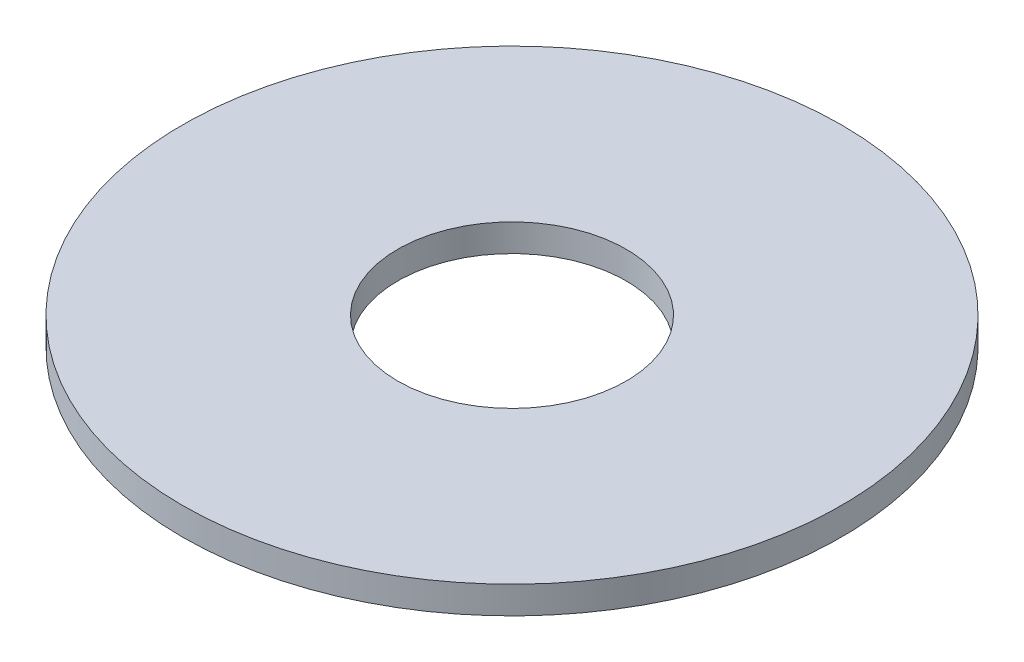
ISO-10303-21;
HEADER;
FILE_DESCRIPTION(('STEP AP214'),'2;1');
FILE_NAME('part.step','',(''),(''),'','','');
FILE_SCHEMA(('AUTOMOTIVE_DESIGN { 1 0 10303 214 1 1 1 1 }'));
ENDSEC;
DATA;
#1=APPLICATION_CONTEXT('core data for automotive mechanical design processes');
#2=APPLICATION_PROTOCOL_DEFINITION('international standard','automotive_design',2000,#1);
#3=PRODUCT_CONTEXT('',#1,'mechanical');
#4=PRODUCT('Part','Part','',(#3));
#5=PRODUCT_RELATED_PRODUCT_CATEGORY('part','',(#4));
#6=PRODUCT_DEFINITION_FORMATION('','',#4);
#7=PRODUCT_DEFINITION_CONTEXT('part definition',#1,'design');
#8=PRODUCT_DEFINITION('design','',#6,#7);
#9=PRODUCT_DEFINITION_SHAPE('','',#8);
#10=(LENGTH_UNIT() NAMED_UNIT(*) SI_UNIT(.MILLI.,.METRE.));
#11=(NAMED_UNIT(*) PLANE_ANGLE_UNIT() SI_UNIT($,.RADIAN.));
#12=(NAMED_UNIT(*) SI_UNIT($,.STERADIAN.) SOLID_ANGLE_UNIT());
#13=UNCERTAINTY_MEASURE_WITH_UNIT(LENGTH_MEASURE(1.E-05),#10,'distance_accuracy_value','');
#14=(GEOMETRIC_REPRESENTATION_CONTEXT(3) GLOBAL_UNCERTAINTY_ASSIGNED_CONTEXT((#13)) GLOBAL_UNIT_ASSIGNED_CONTEXT((#10,
#11,#12)) REPRESENTATION_CONTEXT('',''));
#15=CARTESIAN_POINT('',(0.,0.,0.));
#16=DIRECTION('',(0.,0.,1.));
#17=DIRECTION('',(1.,0.,0.));
#18=AXIS2_PLACEMENT_3D('',#15,#16,#17);
#19=CARTESIAN_POINT('',(0.,-0.396875,0.));
#20=DIRECTION('',(0.,1.,0.));
#21=DIRECTION('',(0.,0.,1.));
#22=AXIS2_PLACEMENT_3D('',#19,#20,#21);
#23=PLANE('',#22);
#24=CARTESIAN_POINT('',(0.,-0.396875,0.));
#25=DIRECTION('',(0.,1.,0.));
#26=DIRECTION('',(0.,0.,1.));
#27=AXIS2_PLACEMENT_3D('',#24,#25,#26);
#28=CIRCLE('',#27,3.302);
#29=CARTESIAN_POINT('',(0.,-0.396875,3.302));
#30=VERTEX_POINT('',#29);
#31=EDGE_CURVE('E27',#30,#30,#28,.T.);
#32=ORIENTED_EDGE('',*,*,#31,.T.);
#33=EDGE_LOOP('',(#32));
#34=FACE_BOUND('',#33,.T.);
#35=CARTESIAN_POINT('',(0.,-0.396875,0.));
#36=DIRECTION('',(0.,1.,0.));
#37=DIRECTION('',(0.,0.,1.));
#38=AXIS2_PLACEMENT_3D('',#35,#36,#37);
#39=CIRCLE('',#38,9.525);
#40=CARTESIAN_POINT('',(0.,-0.396875,9.525));
#41=VERTEX_POINT('',#40);
#42=EDGE_CURVE('E18',#41,#41,#39,.T.);
#43=ORIENTED_EDGE('',*,*,#42,.F.);
#44=EDGE_LOOP('',(#43));
#45=FACE_BOUND('',#44,.T.);
#46=ADVANCED_FACE('F15',(#34,#45),#23,.F.);
#47=CARTESIAN_POINT('',(0.,0.396875,0.));
#48=DIRECTION('',(0.,1.,0.));
#49=DIRECTION('',(0.,0.,1.));
#50=AXIS2_PLACEMENT_3D('',#47,#48,#49);
#51=CYLINDRICAL_SURFACE('',#50,9.525);
#52=ORIENTED_EDGE('',*,*,#42,.T.);
#53=EDGE_LOOP('',(#52));
#54=FACE_BOUND('',#53,.T.);
#55=CARTESIAN_POINT('',(0.,0.396875,0.));
#56=DIRECTION('',(0.,1.,0.));
#57=DIRECTION('',(0.,0.,1.));
#58=AXIS2_PLACEMENT_3D('',#55,#56,#57);
#59=CIRCLE('',#58,9.525);
#60=CARTESIAN_POINT('',(0.,0.396875,9.525));
#61=VERTEX_POINT('',#60);
#62=EDGE_CURVE('E22',#61,#61,#59,.T.);
#63=ORIENTED_EDGE('',*,*,#62,.F.);
#64=EDGE_LOOP('',(#63));
#65=FACE_BOUND('',#64,.T.);
#66=ADVANCED_FACE('F35',(#54,#65),#51,.T.);
#67=CARTESIAN_POINT('',(0.,0.396875,0.));
#68=DIRECTION('',(0.,1.,0.));
#69=DIRECTION('',(0.,0.,1.));
#70=AXIS2_PLACEMENT_3D('',#67,#68,#69);
#71=CYLINDRICAL_SURFACE('',#70,3.302);
#72=ORIENTED_EDGE('',*,*,#31,.F.);
#73=EDGE_LOOP('',(#72));
#74=FACE_BOUND('',#73,.T.);
#75=CARTESIAN_POINT('',(0.,0.396875,0.));
#76=DIRECTION('',(0.,1.,0.));
#77=DIRECTION('',(0.,0.,1.));
#78=AXIS2_PLACEMENT_3D('',#75,#76,#77);
#79=CIRCLE('',#78,3.302);
#80=CARTESIAN_POINT('',(0.,0.396875,3.302));
#81=VERTEX_POINT('',#80);
#82=EDGE_CURVE('E10',#81,#81,#79,.F.);
#83=ORIENTED_EDGE('',*,*,#82,.F.);
#84=EDGE_LOOP('',(#83));
#85=FACE_BOUND('',#84,.T.);
#86=ADVANCED_FACE('F43',(#74,#85),#71,.F.);
#87=CARTESIAN_POINT('',(0.,0.396875,0.));
#88=DIRECTION('',(0.,1.,0.));
#89=DIRECTION('',(0.,0.,1.));
#90=AXIS2_PLACEMENT_3D('',#87,#88,#89);
#91=PLANE('',#90);
#92=ORIENTED_EDGE('',*,*,#82,.T.);
#93=EDGE_LOOP('',(#92));
#94=FACE_BOUND('',#93,.T.);
#95=ORIENTED_EDGE('',*,*,#62,.T.);
#96=EDGE_LOOP('',(#95));
#97=FACE_BOUND('',#96,.T.);
#98=ADVANCED_FACE('F44',(#94,#97),#91,.T.);
#99=CLOSED_SHELL('',(#46,#66,#86,#98));
#100=MANIFOLD_SOLID_BREP('B1',#99);
#101=ADVANCED_BREP_SHAPE_REPRESENTATION('',(#18,#100),#14);
#102=SHAPE_DEFINITION_REPRESENTATION(#9,#101);
ENDSEC;
END-ISO-10303-21;
